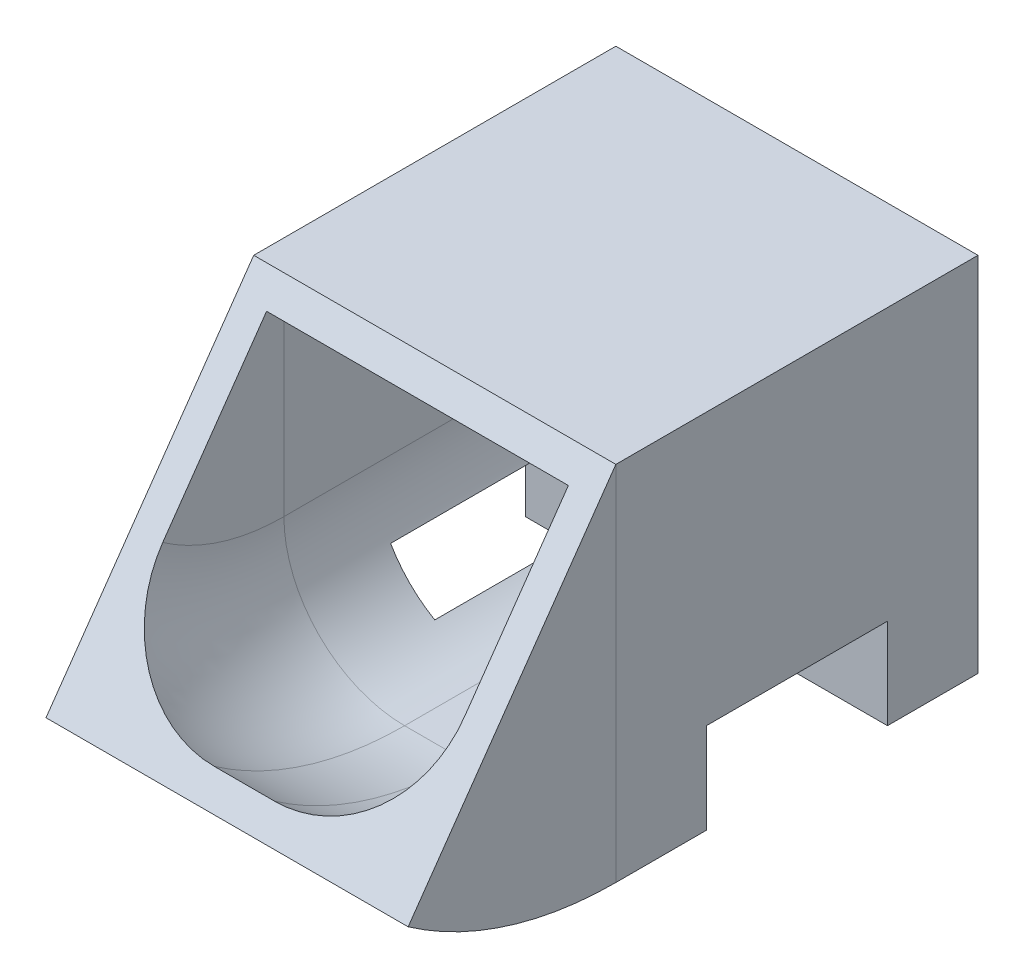
ISO-10303-21;
HEADER;
FILE_DESCRIPTION(('STEP AP214'),'2;1');
FILE_NAME('part.step','',(''),(''),'','','');
FILE_SCHEMA(('AUTOMOTIVE_DESIGN { 1 0 10303 214 1 1 1 1 }'));
ENDSEC;
DATA;
#1=APPLICATION_CONTEXT('core data for automotive mechanical design processes');
#2=APPLICATION_PROTOCOL_DEFINITION('international standard','automotive_design',2000,#1);
#3=PRODUCT_CONTEXT('',#1,'mechanical');
#4=PRODUCT('Part','Part','',(#3));
#5=PRODUCT_RELATED_PRODUCT_CATEGORY('part','',(#4));
#6=PRODUCT_DEFINITION_FORMATION('','',#4);
#7=PRODUCT_DEFINITION_CONTEXT('part definition',#1,'design');
#8=PRODUCT_DEFINITION('design','',#6,#7);
#9=PRODUCT_DEFINITION_SHAPE('','',#8);
#10=(LENGTH_UNIT() NAMED_UNIT(*) SI_UNIT(.MILLI.,.METRE.));
#11=(NAMED_UNIT(*) PLANE_ANGLE_UNIT() SI_UNIT($,.RADIAN.));
#12=(NAMED_UNIT(*) SI_UNIT($,.STERADIAN.) SOLID_ANGLE_UNIT());
#13=UNCERTAINTY_MEASURE_WITH_UNIT(LENGTH_MEASURE(1.E-05),#10,'distance_accuracy_value','');
#14=(GEOMETRIC_REPRESENTATION_CONTEXT(3) GLOBAL_UNCERTAINTY_ASSIGNED_CONTEXT((#13)) GLOBAL_UNIT_ASSIGNED_CONTEXT((#10,
#11,#12)) REPRESENTATION_CONTEXT('',''));
#15=CARTESIAN_POINT('',(0.,0.,0.));
#16=DIRECTION('',(0.,0.,1.));
#17=DIRECTION('',(1.,0.,0.));
#18=AXIS2_PLACEMENT_3D('',#15,#16,#17);
#19=CARTESIAN_POINT('',(0.,60.,60.));
#20=DIRECTION('',(1.,0.,0.));
#21=DIRECTION('',(0.,0.,-1.));
#22=AXIS2_PLACEMENT_3D('',#19,#20,#21);
#23=PLANE('',#22);
#24=CARTESIAN_POINT('',(0.,60.,60.));
#25=DIRECTION('',(1.,0.,0.));
#26=DIRECTION('',(0.,0.,-1.));
#27=AXIS2_PLACEMENT_3D('',#24,#25,#26);
#28=CIRCLE('',#27,60.);
#29=CARTESIAN_POINT('',(0.,10.8508773426605,94.4145861810628));
#30=VERTEX_POINT('',#29);
#31=CARTESIAN_POINT('',(0.,0.,60.));
#32=VERTEX_POINT('',#31);
#33=EDGE_CURVE('E173',#30,#32,#28,.T.);
#34=ORIENTED_EDGE('',*,*,#33,.F.);
#35=DIRECTION('',(0.,-0.819152044288991,0.573576436351047));
#36=VECTOR('',#35,1.);
#37=CARTESIAN_POINT('',(0.,60.,60.));
#38=LINE('',#37,#36);
#39=CARTESIAN_POINT('',(0.,60.,60.));
#40=VERTEX_POINT('',#39);
#41=EDGE_CURVE('E159',#40,#30,#38,.T.);
#42=ORIENTED_EDGE('',*,*,#41,.F.);
#43=DIRECTION('',(0.,-1.,0.));
#44=VECTOR('',#43,1.);
#45=CARTESIAN_POINT('',(0.,60.,60.));
#46=LINE('',#45,#44);
#47=EDGE_CURVE('E142',#40,#32,#46,.T.);
#48=ORIENTED_EDGE('',*,*,#47,.T.);
#49=EDGE_LOOP('',(#34,#42,#48));
#50=FACE_BOUND('',#49,.T.);
#51=ADVANCED_FACE('F43',(#50),#23,.F.);
#52=CARTESIAN_POINT('',(0.,60.,60.));
#53=DIRECTION('',(1.,0.,0.));
#54=DIRECTION('',(0.,0.,-1.));
#55=AXIS2_PLACEMENT_3D('',#52,#53,#54);
#56=CYLINDRICAL_SURFACE('',#55,60.);
#57=CARTESIAN_POINT('',(60.,60.,60.));
#58=DIRECTION('',(1.,0.,0.));
#59=DIRECTION('',(0.,0.,-1.));
#60=AXIS2_PLACEMENT_3D('',#57,#58,#59);
#61=CIRCLE('',#60,60.);
#62=CARTESIAN_POINT('',(60.,10.8508773426605,94.4145861810628));
#63=VERTEX_POINT('',#62);
#64=CARTESIAN_POINT('',(60.,0.,60.));
#65=VERTEX_POINT('',#64);
#66=EDGE_CURVE('E123',#63,#65,#61,.T.);
#67=ORIENTED_EDGE('',*,*,#66,.F.);
#68=DIRECTION('',(1.,0.,0.));
#69=VECTOR('',#68,1.);
#70=CARTESIAN_POINT('',(0.,10.8508773426605,94.4145861810628));
#71=LINE('',#70,#69);
#72=EDGE_CURVE('E162',#30,#63,#71,.T.);
#73=ORIENTED_EDGE('',*,*,#72,.F.);
#74=ORIENTED_EDGE('',*,*,#33,.T.);
#75=DIRECTION('',(1.,0.,0.));
#76=VECTOR('',#75,1.);
#77=CARTESIAN_POINT('',(0.,0.,60.));
#78=LINE('',#77,#76);
#79=EDGE_CURVE('E145',#32,#65,#78,.T.);
#80=ORIENTED_EDGE('',*,*,#79,.T.);
#81=EDGE_LOOP('',(#67,#73,#74,#80));
#82=FACE_BOUND('',#81,.T.);
#83=ADVANCED_FACE('F204',(#82),#56,.T.);
#84=CARTESIAN_POINT('',(60.,60.,60.));
#85=DIRECTION('',(-1.,0.,0.));
#86=DIRECTION('',(0.,0.,1.));
#87=AXIS2_PLACEMENT_3D('',#84,#85,#86);
#88=PLANE('',#87);
#89=DIRECTION('',(0.,1.,0.));
#90=VECTOR('',#89,1.);
#91=CARTESIAN_POINT('',(60.,60.,60.));
#92=LINE('',#91,#90);
#93=CARTESIAN_POINT('',(60.,60.,60.));
#94=VERTEX_POINT('',#93);
#95=EDGE_CURVE('E148',#65,#94,#92,.T.);
#96=ORIENTED_EDGE('',*,*,#95,.T.);
#97=DIRECTION('',(0.,0.819152044288991,-0.573576436351047));
#98=VECTOR('',#97,1.);
#99=CARTESIAN_POINT('',(60.,60.,60.));
#100=LINE('',#99,#98);
#101=EDGE_CURVE('E165',#63,#94,#100,.T.);
#102=ORIENTED_EDGE('',*,*,#101,.F.);
#103=ORIENTED_EDGE('',*,*,#66,.T.);
#104=EDGE_LOOP('',(#96,#102,#103));
#105=FACE_BOUND('',#104,.T.);
#106=ADVANCED_FACE('F210',(#105),#88,.F.);
#107=CARTESIAN_POINT('',(5.,55.904239778555,62.8678821817552));
#108=DIRECTION('',(1.,0.,0.));
#109=DIRECTION('',(0.,0.,-1.));
#110=AXIS2_PLACEMENT_3D('',#107,#108,#109);
#111=PLANE('',#110);
#112=DIRECTION('',(0.,-0.819152044288991,0.573576436351047));
#113=VECTOR('',#112,1.);
#114=CARTESIAN_POINT('',(5.,55.904239778555,62.8678821817552));
#115=LINE('',#114,#113);
#116=CARTESIAN_POINT('',(5.,55.904239778555,62.8678821817552));
#117=VERTEX_POINT('',#116);
#118=CARTESIAN_POINT('',(5.,31.3296784498853,80.0751752722867));
#119=VERTEX_POINT('',#118);
#120=EDGE_CURVE('E151',#117,#119,#115,.T.);
#121=ORIENTED_EDGE('',*,*,#120,.T.);
#122=CARTESIAN_POINT('',(5.,60.,60.));
#123=DIRECTION('',(1.,0.,0.));
#124=DIRECTION('',(0.,0.,-1.));
#125=AXIS2_PLACEMENT_3D('',#122,#123,#124);
#126=CIRCLE('',#125,35.);
#127=CARTESIAN_POINT('',(5.,25.,60.));
#128=VERTEX_POINT('',#127);
#129=EDGE_CURVE('E131',#119,#128,#126,.T.);
#130=ORIENTED_EDGE('',*,*,#129,.T.);
#131=DIRECTION('',(0.,-1.,0.));
#132=VECTOR('',#131,1.);
#133=CARTESIAN_POINT('',(5.,55.,60.));
#134=LINE('',#133,#132);
#135=CARTESIAN_POINT('',(5.,55.,60.));
#136=VERTEX_POINT('',#135);
#137=EDGE_CURVE('E128',#136,#128,#134,.T.);
#138=ORIENTED_EDGE('',*,*,#137,.F.);
#139=CARTESIAN_POINT('',(5.,60.,60.));
#140=DIRECTION('',(1.,0.,0.));
#141=DIRECTION('',(0.,0.,-1.));
#142=AXIS2_PLACEMENT_3D('',#139,#140,#141);
#143=CIRCLE('',#142,5.);
#144=EDGE_CURVE('E112',#117,#136,#143,.T.);
#145=ORIENTED_EDGE('',*,*,#144,.F.);
#146=EDGE_LOOP('',(#121,#130,#138,#145));
#147=FACE_BOUND('',#146,.T.);
#148=ADVANCED_FACE('F129',(#147),#111,.T.);
#149=CARTESIAN_POINT('',(0.,60.,60.));
#150=DIRECTION('',(1.,0.,0.));
#151=DIRECTION('',(0.,0.,-1.));
#152=AXIS2_PLACEMENT_3D('',#149,#150,#151);
#153=CYLINDRICAL_SURFACE('',#152,5.);
#154=CARTESIAN_POINT('',(55.,60.,60.));
#155=DIRECTION('',(1.,0.,0.));
#156=DIRECTION('',(0.,0.,-1.));
#157=AXIS2_PLACEMENT_3D('',#154,#155,#156);
#158=CIRCLE('',#157,5.);
#159=CARTESIAN_POINT('',(55.,55.904239778555,62.8678821817552));
#160=VERTEX_POINT('',#159);
#161=CARTESIAN_POINT('',(55.,55.,60.));
#162=VERTEX_POINT('',#161);
#163=EDGE_CURVE('E124',#160,#162,#158,.T.);
#164=ORIENTED_EDGE('',*,*,#163,.F.);
#165=DIRECTION('',(-1.,0.,0.));
#166=VECTOR('',#165,1.);
#167=CARTESIAN_POINT('',(5.,55.904239778555,62.8678821817552));
#168=LINE('',#167,#166);
#169=EDGE_CURVE('E119',#160,#117,#168,.T.);
#170=ORIENTED_EDGE('',*,*,#169,.T.);
#171=ORIENTED_EDGE('',*,*,#144,.T.);
#172=DIRECTION('',(-1.,0.,0.));
#173=VECTOR('',#172,1.);
#174=CARTESIAN_POINT('',(5.,55.,60.));
#175=LINE('',#174,#173);
#176=EDGE_CURVE('E117',#162,#136,#175,.T.);
#177=ORIENTED_EDGE('',*,*,#176,.F.);
#178=EDGE_LOOP('',(#164,#170,#171,#177));
#179=FACE_BOUND('',#178,.T.);
#180=ADVANCED_FACE('F115',(#179),#153,.T.);
#181=CARTESIAN_POINT('',(55.,55.904239778555,62.8678821817552));
#182=DIRECTION('',(-1.,0.,0.));
#183=DIRECTION('',(0.,0.,1.));
#184=AXIS2_PLACEMENT_3D('',#181,#182,#183);
#185=PLANE('',#184);
#186=DIRECTION('',(0.,1.,0.));
#187=VECTOR('',#186,1.);
#188=CARTESIAN_POINT('',(55.,55.,60.));
#189=LINE('',#188,#187);
#190=CARTESIAN_POINT('',(55.,25.,60.));
#191=VERTEX_POINT('',#190);
#192=EDGE_CURVE('E135',#191,#162,#189,.T.);
#193=ORIENTED_EDGE('',*,*,#192,.F.);
#194=CARTESIAN_POINT('',(55.,60.,60.));
#195=DIRECTION('',(-1.,0.,0.));
#196=DIRECTION('',(0.,0.,1.));
#197=AXIS2_PLACEMENT_3D('',#194,#195,#196);
#198=CIRCLE('',#197,35.);
#199=CARTESIAN_POINT('',(55.,31.3296784498853,80.0751752722867));
#200=VERTEX_POINT('',#199);
#201=EDGE_CURVE('E64',#191,#200,#198,.T.);
#202=ORIENTED_EDGE('',*,*,#201,.T.);
#203=DIRECTION('',(0.,0.819152044288991,-0.573576436351047));
#204=VECTOR('',#203,1.);
#205=CARTESIAN_POINT('',(55.,55.904239778555,62.8678821817552));
#206=LINE('',#205,#204);
#207=EDGE_CURVE('E154',#200,#160,#206,.T.);
#208=ORIENTED_EDGE('',*,*,#207,.T.);
#209=ORIENTED_EDGE('',*,*,#163,.T.);
#210=EDGE_LOOP('',(#193,#202,#208,#209));
#211=FACE_BOUND('',#210,.T.);
#212=ADVANCED_FACE('F235',(#211),#185,.T.);
#213=CARTESIAN_POINT('',(0.,60.,60.));
#214=DIRECTION('',(1.,0.,0.));
#215=DIRECTION('',(0.,0.,-1.));
#216=AXIS2_PLACEMENT_3D('',#213,#214,#215);
#217=CYLINDRICAL_SURFACE('',#216,55.);
#218=DIRECTION('',(1.,0.,0.));
#219=VECTOR('',#218,1.);
#220=CARTESIAN_POINT('',(5.,14.9466375641055,91.5467039993076));
#221=LINE('',#220,#219);
#222=CARTESIAN_POINT('',(25.,14.9466375641055,91.5467039993076));
#223=VERTEX_POINT('',#222);
#224=CARTESIAN_POINT('',(35.,14.9466375641055,91.5467039993076));
#225=VERTEX_POINT('',#224);
#226=EDGE_CURVE('E156',#223,#225,#221,.T.);
#227=ORIENTED_EDGE('',*,*,#226,.T.);
#228=CARTESIAN_POINT('',(35.,60.,60.));
#229=DIRECTION('',(-1.,0.,0.));
#230=DIRECTION('',(0.,0.,1.));
#231=AXIS2_PLACEMENT_3D('',#228,#229,#230);
#232=CIRCLE('',#231,55.);
#233=CARTESIAN_POINT('',(35.,4.99999999999999,60.));
#234=VERTEX_POINT('',#233);
#235=EDGE_CURVE('E182',#225,#234,#232,.F.);
#236=ORIENTED_EDGE('',*,*,#235,.T.);
#237=DIRECTION('',(1.,0.,0.));
#238=VECTOR('',#237,1.);
#239=CARTESIAN_POINT('',(5.,4.99999999999999,60.));
#240=LINE('',#239,#238);
#241=CARTESIAN_POINT('',(25.,4.99999999999999,60.));
#242=VERTEX_POINT('',#241);
#243=EDGE_CURVE('E138',#242,#234,#240,.T.);
#244=ORIENTED_EDGE('',*,*,#243,.F.);
#245=CARTESIAN_POINT('',(25.,60.,60.));
#246=DIRECTION('',(1.,0.,0.));
#247=DIRECTION('',(0.,0.,-1.));
#248=AXIS2_PLACEMENT_3D('',#245,#246,#247);
#249=CIRCLE('',#248,55.);
#250=EDGE_CURVE('E176',#242,#223,#249,.F.);
#251=ORIENTED_EDGE('',*,*,#250,.T.);
#252=EDGE_LOOP('',(#227,#236,#244,#251));
#253=FACE_BOUND('',#252,.T.);
#254=ADVANCED_FACE('F188',(#253),#217,.F.);
#255=CARTESIAN_POINT('',(0.,10.8508773426605,94.4145861810628));
#256=DIRECTION('',(0.,0.573576436351047,0.819152044288991));
#257=DIRECTION('',(1.,0.,0.));
#258=AXIS2_PLACEMENT_3D('',#255,#256,#257);
#259=PLANE('',#258);
#260=ORIENTED_EDGE('',*,*,#120,.F.);
#261=ORIENTED_EDGE('',*,*,#169,.F.);
#262=ORIENTED_EDGE('',*,*,#207,.F.);
#263=CARTESIAN_POINT('',(35.,31.3296784498853,80.0751752722867));
#264=DIRECTION('',(0.,0.573576436351047,0.819152044288991));
#265=DIRECTION('',(0.,-0.819152044288991,0.573576436351047));
#266=AXIS2_PLACEMENT_3D('',#263,#264,#265);
#267=CIRCLE('',#266,20.);
#268=EDGE_CURVE('E12',#200,#225,#267,.F.);
#269=ORIENTED_EDGE('',*,*,#268,.T.);
#270=ORIENTED_EDGE('',*,*,#226,.F.);
#271=CARTESIAN_POINT('',(25.,31.3296784498853,80.0751752722867));
#272=DIRECTION('',(0.,0.573576436351047,0.819152044288991));
#273=DIRECTION('',(0.,-0.819152044288991,0.573576436351047));
#274=AXIS2_PLACEMENT_3D('',#271,#272,#273);
#275=CIRCLE('',#274,20.);
#276=EDGE_CURVE('E180',#223,#119,#275,.F.);
#277=ORIENTED_EDGE('',*,*,#276,.T.);
#278=EDGE_LOOP('',(#260,#261,#262,#269,#270,#277));
#279=FACE_BOUND('',#278,.T.);
#280=ORIENTED_EDGE('',*,*,#41,.T.);
#281=ORIENTED_EDGE('',*,*,#72,.T.);
#282=ORIENTED_EDGE('',*,*,#101,.T.);
#283=DIRECTION('',(-1.,0.,0.));
#284=VECTOR('',#283,1.);
#285=CARTESIAN_POINT('',(0.,60.,60.));
#286=LINE('',#285,#284);
#287=EDGE_CURVE('E168',#94,#40,#286,.T.);
#288=ORIENTED_EDGE('',*,*,#287,.T.);
#289=EDGE_LOOP('',(#280,#281,#282,#288));
#290=FACE_BOUND('',#289,.T.);
#291=ADVANCED_FACE('F197',(#279,#290),#259,.T.);
#292=CARTESIAN_POINT('',(0.,0.,60.));
#293=DIRECTION('',(0.,0.,1.));
#294=DIRECTION('',(1.,0.,0.));
#295=AXIS2_PLACEMENT_3D('',#292,#293,#294);
#296=PLANE('',#295);
#297=ORIENTED_EDGE('',*,*,#137,.T.);
#298=CARTESIAN_POINT('',(25.,25.,60.));
#299=DIRECTION('',(0.,0.,1.));
#300=DIRECTION('',(1.,0.,0.));
#301=AXIS2_PLACEMENT_3D('',#298,#299,#300);
#302=CIRCLE('',#301,20.);
#303=EDGE_CURVE('E178',#128,#242,#302,.T.);
#304=ORIENTED_EDGE('',*,*,#303,.T.);
#305=ORIENTED_EDGE('',*,*,#243,.T.);
#306=CARTESIAN_POINT('',(35.,25.,60.));
#307=DIRECTION('',(0.,0.,1.));
#308=DIRECTION('',(1.,0.,0.));
#309=AXIS2_PLACEMENT_3D('',#306,#307,#308);
#310=CIRCLE('',#309,20.);
#311=EDGE_CURVE('E51',#234,#191,#310,.T.);
#312=ORIENTED_EDGE('',*,*,#311,.T.);
#313=ORIENTED_EDGE('',*,*,#192,.T.);
#314=ORIENTED_EDGE('',*,*,#176,.T.);
#315=EDGE_LOOP('',(#297,#304,#305,#312,#313,#314));
#316=FACE_BOUND('',#315,.T.);
#317=ORIENTED_EDGE('',*,*,#47,.F.);
#318=ORIENTED_EDGE('',*,*,#287,.F.);
#319=ORIENTED_EDGE('',*,*,#95,.F.);
#320=ORIENTED_EDGE('',*,*,#79,.F.);
#321=EDGE_LOOP('',(#317,#318,#319,#320));
#322=FACE_BOUND('',#321,.T.);
#323=ADVANCED_FACE('F133',(#316,#322),#296,.F.);
#324=CARTESIAN_POINT('',(25.,60.,60.));
#325=DIRECTION('',(1.,0.,0.));
#326=DIRECTION('',(0.,0.,-1.));
#327=AXIS2_PLACEMENT_3D('',#324,#325,#326);
#328=TOROIDAL_SURFACE('',#327,35.,20.);
#329=ORIENTED_EDGE('',*,*,#276,.F.);
#330=ORIENTED_EDGE('',*,*,#250,.F.);
#331=ORIENTED_EDGE('',*,*,#303,.F.);
#332=ORIENTED_EDGE('',*,*,#129,.F.);
#333=EDGE_LOOP('',(#329,#330,#331,#332));
#334=FACE_BOUND('',#333,.T.);
#335=ADVANCED_FACE('F195',(#334),#328,.F.);
#336=CARTESIAN_POINT('',(35.,60.,60.));
#337=DIRECTION('',(-1.,0.,0.));
#338=DIRECTION('',(0.,0.,1.));
#339=AXIS2_PLACEMENT_3D('',#336,#337,#338);
#340=TOROIDAL_SURFACE('',#339,35.,20.);
#341=ORIENTED_EDGE('',*,*,#268,.F.);
#342=ORIENTED_EDGE('',*,*,#201,.F.);
#343=ORIENTED_EDGE('',*,*,#311,.F.);
#344=ORIENTED_EDGE('',*,*,#235,.F.);
#345=EDGE_LOOP('',(#341,#342,#343,#344));
#346=FACE_BOUND('',#345,.T.);
#347=ADVANCED_FACE('F45',(#346),#340,.F.);
#348=CLOSED_SHELL('',(#51,#83,#106,#148,#180,#212,#254,#291,#323,#335,#347));
#349=MANIFOLD_SOLID_BREP('B2',#348);
#350=CARTESIAN_POINT('',(0.,0.,60.));
#351=DIRECTION('',(0.,0.,-1.));
#352=DIRECTION('',(-1.,0.,0.));
#353=AXIS2_PLACEMENT_3D('',#350,#351,#352);
#354=PLANE('',#353);
#355=DIRECTION('',(0.,-1.,0.));
#356=VECTOR('',#355,1.);
#357=CARTESIAN_POINT('',(0.,0.,60.));
#358=LINE('',#357,#356);
#359=CARTESIAN_POINT('',(0.,60.,60.));
#360=VERTEX_POINT('',#359);
#361=CARTESIAN_POINT('',(0.,0.,60.));
#362=VERTEX_POINT('',#361);
#363=EDGE_CURVE('E595',#360,#362,#358,.T.);
#364=ORIENTED_EDGE('',*,*,#363,.T.);
#365=DIRECTION('',(1.,0.,0.));
#366=VECTOR('',#365,1.);
#367=CARTESIAN_POINT('',(0.,0.,60.));
#368=LINE('',#367,#366);
#369=CARTESIAN_POINT('',(60.,0.,60.));
#370=VERTEX_POINT('',#369);
#371=EDGE_CURVE('E598',#362,#370,#368,.T.);
#372=ORIENTED_EDGE('',*,*,#371,.T.);
#373=DIRECTION('',(0.,1.,0.));
#374=VECTOR('',#373,1.);
#375=CARTESIAN_POINT('',(60.,0.,60.));
#376=LINE('',#375,#374);
#377=CARTESIAN_POINT('',(60.,60.,60.));
#378=VERTEX_POINT('',#377);
#379=EDGE_CURVE('E601',#370,#378,#376,.T.);
#380=ORIENTED_EDGE('',*,*,#379,.T.);
#381=DIRECTION('',(-1.,0.,0.));
#382=VECTOR('',#381,1.);
#383=CARTESIAN_POINT('',(0.,60.,60.));
#384=LINE('',#383,#382);
#385=EDGE_CURVE('E603',#378,#360,#384,.T.);
#386=ORIENTED_EDGE('',*,*,#385,.T.);
#387=EDGE_LOOP('',(#364,#372,#380,#386));
#388=FACE_BOUND('',#387,.T.);
#389=DIRECTION('',(0.,-1.,0.));
#390=VECTOR('',#389,1.);
#391=CARTESIAN_POINT('',(5.,4.99999999999999,60.));
#392=LINE('',#391,#390);
#393=CARTESIAN_POINT('',(5.,55.,60.));
#394=VERTEX_POINT('',#393);
#395=CARTESIAN_POINT('',(5.,25.,60.));
#396=VERTEX_POINT('',#395);
#397=EDGE_CURVE('E444',#394,#396,#392,.T.);
#398=ORIENTED_EDGE('',*,*,#397,.F.);
#399=DIRECTION('',(-1.,0.,0.));
#400=VECTOR('',#399,1.);
#401=CARTESIAN_POINT('',(5.,55.,60.));
#402=LINE('',#401,#400);
#403=CARTESIAN_POINT('',(55.,55.,60.));
#404=VERTEX_POINT('',#403);
#405=EDGE_CURVE('E581',#404,#394,#402,.T.);
#406=ORIENTED_EDGE('',*,*,#405,.F.);
#407=DIRECTION('',(0.,1.,0.));
#408=VECTOR('',#407,1.);
#409=CARTESIAN_POINT('',(55.,4.99999999999999,60.));
#410=LINE('',#409,#408);
#411=CARTESIAN_POINT('',(55.,25.,60.));
#412=VERTEX_POINT('',#411);
#413=EDGE_CURVE('E579',#412,#404,#410,.T.);
#414=ORIENTED_EDGE('',*,*,#413,.F.);
#415=CARTESIAN_POINT('',(35.,25.,60.));
#416=DIRECTION('',(0.,0.,-1.));
#417=DIRECTION('',(-1.,0.,0.));
#418=AXIS2_PLACEMENT_3D('',#415,#416,#417);
#419=CIRCLE('',#418,20.);
#420=CARTESIAN_POINT('',(35.,4.99999999999999,60.));
#421=VERTEX_POINT('',#420);
#422=EDGE_CURVE('E461',#412,#421,#419,.T.);
#423=ORIENTED_EDGE('',*,*,#422,.T.);
#424=DIRECTION('',(1.,0.,0.));
#425=VECTOR('',#424,1.);
#426=CARTESIAN_POINT('',(5.,4.99999999999999,60.));
#427=LINE('',#426,#425);
#428=CARTESIAN_POINT('',(25.,4.99999999999999,60.));
#429=VERTEX_POINT('',#428);
#430=EDGE_CURVE('E446',#429,#421,#427,.T.);
#431=ORIENTED_EDGE('',*,*,#430,.F.);
#432=CARTESIAN_POINT('',(25.,25.,60.));
#433=DIRECTION('',(0.,0.,-1.));
#434=DIRECTION('',(-1.,0.,0.));
#435=AXIS2_PLACEMENT_3D('',#432,#433,#434);
#436=CIRCLE('',#435,20.);
#437=EDGE_CURVE('E41',#429,#396,#436,.T.);
#438=ORIENTED_EDGE('',*,*,#437,.T.);
#439=EDGE_LOOP('',(#398,#406,#414,#423,#431,#438));
#440=FACE_BOUND('',#439,.T.);
#441=ADVANCED_FACE('F299',(#388,#440),#354,.F.);
#442=CARTESIAN_POINT('',(0.,0.,0.));
#443=DIRECTION('',(0.,0.,-1.));
#444=DIRECTION('',(-1.,0.,0.));
#445=AXIS2_PLACEMENT_3D('',#442,#443,#444);
#446=PLANE('',#445);
#447=DIRECTION('',(0.,-1.,0.));
#448=VECTOR('',#447,1.);
#449=CARTESIAN_POINT('',(0.,0.,0.));
#450=LINE('',#449,#448);
#451=CARTESIAN_POINT('',(0.,60.,0.));
#452=VERTEX_POINT('',#451);
#453=CARTESIAN_POINT('',(0.,0.,0.));
#454=VERTEX_POINT('',#453);
#455=EDGE_CURVE('E594',#452,#454,#450,.T.);
#456=ORIENTED_EDGE('',*,*,#455,.F.);
#457=DIRECTION('',(-1.,0.,0.));
#458=VECTOR('',#457,1.);
#459=CARTESIAN_POINT('',(0.,60.,0.));
#460=LINE('',#459,#458);
#461=CARTESIAN_POINT('',(60.,60.,0.));
#462=VERTEX_POINT('',#461);
#463=EDGE_CURVE('E599',#462,#452,#460,.T.);
#464=ORIENTED_EDGE('',*,*,#463,.F.);
#465=DIRECTION('',(0.,1.,0.));
#466=VECTOR('',#465,1.);
#467=CARTESIAN_POINT('',(60.,0.,0.));
#468=LINE('',#467,#466);
#469=CARTESIAN_POINT('',(60.,0.,0.));
#470=VERTEX_POINT('',#469);
#471=EDGE_CURVE('E611',#470,#462,#468,.T.);
#472=ORIENTED_EDGE('',*,*,#471,.F.);
#473=DIRECTION('',(1.,0.,0.));
#474=VECTOR('',#473,1.);
#475=CARTESIAN_POINT('',(0.,0.,0.));
#476=LINE('',#475,#474);
#477=EDGE_CURVE('E608',#454,#470,#476,.T.);
#478=ORIENTED_EDGE('',*,*,#477,.F.);
#479=EDGE_LOOP('',(#456,#464,#472,#478));
#480=FACE_BOUND('',#479,.T.);
#481=DIRECTION('',(-1.,0.,0.));
#482=VECTOR('',#481,1.);
#483=CARTESIAN_POINT('',(5.,55.,0.));
#484=LINE('',#483,#482);
#485=CARTESIAN_POINT('',(55.,55.,0.));
#486=VERTEX_POINT('',#485);
#487=CARTESIAN_POINT('',(5.,55.,0.));
#488=VERTEX_POINT('',#487);
#489=EDGE_CURVE('E457',#486,#488,#484,.T.);
#490=ORIENTED_EDGE('',*,*,#489,.T.);
#491=DIRECTION('',(0.,-1.,0.));
#492=VECTOR('',#491,1.);
#493=CARTESIAN_POINT('',(5.,4.99999999999999,0.));
#494=LINE('',#493,#492);
#495=CARTESIAN_POINT('',(5.,25.,0.));
#496=VERTEX_POINT('',#495);
#497=EDGE_CURVE('E473',#488,#496,#494,.T.);
#498=ORIENTED_EDGE('',*,*,#497,.T.);
#499=CARTESIAN_POINT('',(25.,25.,0.));
#500=DIRECTION('',(0.,0.,-1.));
#501=DIRECTION('',(-1.,0.,0.));
#502=AXIS2_PLACEMENT_3D('',#499,#500,#501);
#503=CIRCLE('',#502,20.);
#504=CARTESIAN_POINT('',(25.,4.99999999999999,0.));
#505=VERTEX_POINT('',#504);
#506=EDGE_CURVE('E309',#496,#505,#503,.F.);
#507=ORIENTED_EDGE('',*,*,#506,.T.);
#508=DIRECTION('',(1.,0.,0.));
#509=VECTOR('',#508,1.);
#510=CARTESIAN_POINT('',(5.,4.99999999999999,0.));
#511=LINE('',#510,#509);
#512=CARTESIAN_POINT('',(35.,4.99999999999999,0.));
#513=VERTEX_POINT('',#512);
#514=EDGE_CURVE('E584',#505,#513,#511,.T.);
#515=ORIENTED_EDGE('',*,*,#514,.T.);
#516=CARTESIAN_POINT('',(35.,25.,0.));
#517=DIRECTION('',(0.,0.,-1.));
#518=DIRECTION('',(-1.,0.,0.));
#519=AXIS2_PLACEMENT_3D('',#516,#517,#518);
#520=CIRCLE('',#519,20.);
#521=CARTESIAN_POINT('',(55.,25.,0.));
#522=VERTEX_POINT('',#521);
#523=EDGE_CURVE('E464',#513,#522,#520,.F.);
#524=ORIENTED_EDGE('',*,*,#523,.T.);
#525=DIRECTION('',(0.,1.,0.));
#526=VECTOR('',#525,1.);
#527=CARTESIAN_POINT('',(55.,4.99999999999999,0.));
#528=LINE('',#527,#526);
#529=EDGE_CURVE('E586',#522,#486,#528,.T.);
#530=ORIENTED_EDGE('',*,*,#529,.T.);
#531=EDGE_LOOP('',(#490,#498,#507,#515,#524,#530));
#532=FACE_BOUND('',#531,.T.);
#533=ADVANCED_FACE('F644',(#480,#532),#446,.T.);
#534=CARTESIAN_POINT('',(0.,0.,60.));
#535=DIRECTION('',(1.,0.,0.));
#536=DIRECTION('',(0.,1.,0.));
#537=AXIS2_PLACEMENT_3D('',#534,#535,#536);
#538=PLANE('',#537);
#539=DIRECTION('',(0.,0.,-1.));
#540=VECTOR('',#539,1.);
#541=CARTESIAN_POINT('',(0.,0.,60.));
#542=LINE('',#541,#540);
#543=CARTESIAN_POINT('',(0.,0.,15.));
#544=VERTEX_POINT('',#543);
#545=EDGE_CURVE('E482',#544,#454,#542,.T.);
#546=ORIENTED_EDGE('',*,*,#545,.F.);
#547=DIRECTION('',(0.,-1.,0.));
#548=VECTOR('',#547,1.);
#549=CARTESIAN_POINT('',(0.,0.,15.));
#550=LINE('',#549,#548);
#551=CARTESIAN_POINT('',(0.,15.,15.));
#552=VERTEX_POINT('',#551);
#553=EDGE_CURVE('E505',#552,#544,#550,.T.);
#554=ORIENTED_EDGE('',*,*,#553,.F.);
#555=DIRECTION('',(0.,0.,-1.));
#556=VECTOR('',#555,1.);
#557=CARTESIAN_POINT('',(0.,15.,15.));
#558=LINE('',#557,#556);
#559=CARTESIAN_POINT('',(0.,15.,45.));
#560=VERTEX_POINT('',#559);
#561=EDGE_CURVE('E561',#560,#552,#558,.T.);
#562=ORIENTED_EDGE('',*,*,#561,.F.);
#563=DIRECTION('',(0.,1.,0.));
#564=VECTOR('',#563,1.);
#565=CARTESIAN_POINT('',(0.,0.,45.));
#566=LINE('',#565,#564);
#567=CARTESIAN_POINT('',(0.,0.,45.));
#568=VERTEX_POINT('',#567);
#569=EDGE_CURVE('E566',#568,#560,#566,.T.);
#570=ORIENTED_EDGE('',*,*,#569,.F.);
#571=EDGE_CURVE('E480',#362,#568,#542,.T.);
#572=ORIENTED_EDGE('',*,*,#571,.F.);
#573=ORIENTED_EDGE('',*,*,#363,.F.);
#574=DIRECTION('',(0.,0.,-1.));
#575=VECTOR('',#574,1.);
#576=CARTESIAN_POINT('',(0.,60.,60.));
#577=LINE('',#576,#575);
#578=EDGE_CURVE('E605',#360,#452,#577,.T.);
#579=ORIENTED_EDGE('',*,*,#578,.T.);
#580=ORIENTED_EDGE('',*,*,#455,.T.);
#581=EDGE_LOOP('',(#546,#554,#562,#570,#572,#573,#579,#580));
#582=FACE_BOUND('',#581,.T.);
#583=ADVANCED_FACE('F651',(#582),#538,.F.);
#584=CARTESIAN_POINT('',(0.,0.,60.));
#585=DIRECTION('',(0.,1.,0.));
#586=DIRECTION('',(0.,0.,1.));
#587=AXIS2_PLACEMENT_3D('',#584,#585,#586);
#588=PLANE('',#587);
#589=DIRECTION('',(0.,0.,-1.));
#590=VECTOR('',#589,1.);
#591=CARTESIAN_POINT('',(45.,0.,45.));
#592=LINE('',#591,#590);
#593=CARTESIAN_POINT('',(45.,0.,45.));
#594=VERTEX_POINT('',#593);
#595=CARTESIAN_POINT('',(45.,0.,15.));
#596=VERTEX_POINT('',#595);
#597=EDGE_CURVE('E540',#594,#596,#592,.T.);
#598=ORIENTED_EDGE('',*,*,#597,.F.);
#599=DIRECTION('',(1.,0.,0.));
#600=VECTOR('',#599,1.);
#601=CARTESIAN_POINT('',(45.,0.,45.));
#602=LINE('',#601,#600);
#603=CARTESIAN_POINT('',(60.,0.,45.));
#604=VERTEX_POINT('',#603);
#605=EDGE_CURVE('E538',#594,#604,#602,.T.);
#606=ORIENTED_EDGE('',*,*,#605,.T.);
#607=DIRECTION('',(0.,0.,-1.));
#608=VECTOR('',#607,1.);
#609=CARTESIAN_POINT('',(60.,0.,60.));
#610=LINE('',#609,#608);
#611=EDGE_CURVE('E487',#370,#604,#610,.T.);
#612=ORIENTED_EDGE('',*,*,#611,.F.);
#613=ORIENTED_EDGE('',*,*,#371,.F.);
#614=ORIENTED_EDGE('',*,*,#571,.T.);
#615=DIRECTION('',(-1.,0.,0.));
#616=VECTOR('',#615,1.);
#617=CARTESIAN_POINT('',(15.,0.,45.));
#618=LINE('',#617,#616);
#619=CARTESIAN_POINT('',(15.,0.,45.));
#620=VERTEX_POINT('',#619);
#621=EDGE_CURVE('E574',#620,#568,#618,.T.);
#622=ORIENTED_EDGE('',*,*,#621,.F.);
#623=DIRECTION('',(0.,0.,1.));
#624=VECTOR('',#623,1.);
#625=CARTESIAN_POINT('',(15.,0.,15.));
#626=LINE('',#625,#624);
#627=CARTESIAN_POINT('',(15.,0.,15.));
#628=VERTEX_POINT('',#627);
#629=EDGE_CURVE('E560',#628,#620,#626,.T.);
#630=ORIENTED_EDGE('',*,*,#629,.F.);
#631=DIRECTION('',(-1.,0.,0.));
#632=VECTOR('',#631,1.);
#633=CARTESIAN_POINT('',(15.,0.,15.));
#634=LINE('',#633,#632);
#635=EDGE_CURVE('E564',#628,#544,#634,.T.);
#636=ORIENTED_EDGE('',*,*,#635,.T.);
#637=ORIENTED_EDGE('',*,*,#545,.T.);
#638=ORIENTED_EDGE('',*,*,#477,.T.);
#639=CARTESIAN_POINT('',(60.,0.,15.));
#640=VERTEX_POINT('',#639);
#641=EDGE_CURVE('E617',#640,#470,#610,.T.);
#642=ORIENTED_EDGE('',*,*,#641,.F.);
#643=DIRECTION('',(1.,0.,0.));
#644=VECTOR('',#643,1.);
#645=CARTESIAN_POINT('',(45.,0.,15.));
#646=LINE('',#645,#644);
#647=EDGE_CURVE('E555',#596,#640,#646,.T.);
#648=ORIENTED_EDGE('',*,*,#647,.F.);
#649=EDGE_LOOP('',(#598,#606,#612,#613,#614,#622,#630,#636,#637,#638,#642,#648));
#650=FACE_BOUND('',#649,.T.);
#651=ADVANCED_FACE('F634',(#650),#588,.F.);
#652=CARTESIAN_POINT('',(60.,0.,60.));
#653=DIRECTION('',(-1.,0.,0.));
#654=DIRECTION('',(0.,-1.,0.));
#655=AXIS2_PLACEMENT_3D('',#652,#653,#654);
#656=PLANE('',#655);
#657=ORIENTED_EDGE('',*,*,#611,.T.);
#658=DIRECTION('',(0.,-1.,0.));
#659=VECTOR('',#658,1.);
#660=CARTESIAN_POINT('',(60.,0.,45.));
#661=LINE('',#660,#659);
#662=CARTESIAN_POINT('',(60.,15.,45.));
#663=VERTEX_POINT('',#662);
#664=EDGE_CURVE('E549',#663,#604,#661,.T.);
#665=ORIENTED_EDGE('',*,*,#664,.F.);
#666=DIRECTION('',(0.,0.,1.));
#667=VECTOR('',#666,1.);
#668=CARTESIAN_POINT('',(60.,15.,45.));
#669=LINE('',#668,#667);
#670=CARTESIAN_POINT('',(60.,15.,15.));
#671=VERTEX_POINT('',#670);
#672=EDGE_CURVE('E541',#671,#663,#669,.T.);
#673=ORIENTED_EDGE('',*,*,#672,.F.);
#674=DIRECTION('',(0.,1.,0.));
#675=VECTOR('',#674,1.);
#676=CARTESIAN_POINT('',(60.,0.,15.));
#677=LINE('',#676,#675);
#678=EDGE_CURVE('E545',#640,#671,#677,.T.);
#679=ORIENTED_EDGE('',*,*,#678,.F.);
#680=ORIENTED_EDGE('',*,*,#641,.T.);
#681=ORIENTED_EDGE('',*,*,#471,.T.);
#682=DIRECTION('',(0.,0.,-1.));
#683=VECTOR('',#682,1.);
#684=CARTESIAN_POINT('',(60.,60.,60.));
#685=LINE('',#684,#683);
#686=EDGE_CURVE('E615',#378,#462,#685,.T.);
#687=ORIENTED_EDGE('',*,*,#686,.F.);
#688=ORIENTED_EDGE('',*,*,#379,.F.);
#689=EDGE_LOOP('',(#657,#665,#673,#679,#680,#681,#687,#688));
#690=FACE_BOUND('',#689,.T.);
#691=ADVANCED_FACE('F630',(#690),#656,.F.);
#692=CARTESIAN_POINT('',(0.,60.,60.));
#693=DIRECTION('',(0.,-1.,0.));
#694=DIRECTION('',(1.,0.,0.));
#695=AXIS2_PLACEMENT_3D('',#692,#693,#694);
#696=PLANE('',#695);
#697=ORIENTED_EDGE('',*,*,#463,.T.);
#698=ORIENTED_EDGE('',*,*,#578,.F.);
#699=ORIENTED_EDGE('',*,*,#385,.F.);
#700=ORIENTED_EDGE('',*,*,#686,.T.);
#701=EDGE_LOOP('',(#697,#698,#699,#700));
#702=FACE_BOUND('',#701,.T.);
#703=ADVANCED_FACE('F646',(#702),#696,.F.);
#704=CARTESIAN_POINT('',(5.,4.99999999999999,60.));
#705=DIRECTION('',(1.,0.,0.));
#706=DIRECTION('',(0.,0.,-1.));
#707=AXIS2_PLACEMENT_3D('',#704,#705,#706);
#708=PLANE('',#707);
#709=ORIENTED_EDGE('',*,*,#397,.T.);
#710=DIRECTION('',(0.,0.,-1.));
#711=VECTOR('',#710,1.);
#712=CARTESIAN_POINT('',(5.,25.,45.));
#713=LINE('',#712,#711);
#714=EDGE_CURVE('E454',#396,#496,#713,.T.);
#715=ORIENTED_EDGE('',*,*,#714,.T.);
#716=ORIENTED_EDGE('',*,*,#497,.F.);
#717=DIRECTION('',(0.,0.,-1.));
#718=VECTOR('',#717,1.);
#719=CARTESIAN_POINT('',(5.,55.,60.));
#720=LINE('',#719,#718);
#721=EDGE_CURVE('E456',#394,#488,#720,.T.);
#722=ORIENTED_EDGE('',*,*,#721,.F.);
#723=EDGE_LOOP('',(#709,#715,#716,#722));
#724=FACE_BOUND('',#723,.T.);
#725=ADVANCED_FACE('F453',(#724),#708,.T.);
#726=CARTESIAN_POINT('',(5.,4.99999999999999,60.));
#727=DIRECTION('',(0.,1.,0.));
#728=DIRECTION('',(0.,0.,1.));
#729=AXIS2_PLACEMENT_3D('',#726,#727,#728);
#730=PLANE('',#729);
#731=ORIENTED_EDGE('',*,*,#514,.F.);
#732=DIRECTION('',(0.,0.,-1.));
#733=VECTOR('',#732,1.);
#734=CARTESIAN_POINT('',(25.,4.99999999999999,60.));
#735=LINE('',#734,#733);
#736=EDGE_CURVE('E460',#505,#429,#735,.F.);
#737=ORIENTED_EDGE('',*,*,#736,.T.);
#738=ORIENTED_EDGE('',*,*,#430,.T.);
#739=DIRECTION('',(0.,0.,-1.));
#740=VECTOR('',#739,1.);
#741=CARTESIAN_POINT('',(35.,4.99999999999999,45.));
#742=LINE('',#741,#740);
#743=EDGE_CURVE('E491',#421,#513,#742,.T.);
#744=ORIENTED_EDGE('',*,*,#743,.T.);
#745=EDGE_LOOP('',(#731,#737,#738,#744));
#746=FACE_BOUND('',#745,.T.);
#747=ADVANCED_FACE('F714',(#746),#730,.T.);
#748=CARTESIAN_POINT('',(55.,4.99999999999999,60.));
#749=DIRECTION('',(-1.,0.,0.));
#750=DIRECTION('',(0.,0.,1.));
#751=AXIS2_PLACEMENT_3D('',#748,#749,#750);
#752=PLANE('',#751);
#753=ORIENTED_EDGE('',*,*,#529,.F.);
#754=DIRECTION('',(0.,0.,-1.));
#755=VECTOR('',#754,1.);
#756=CARTESIAN_POINT('',(55.,25.,60.));
#757=LINE('',#756,#755);
#758=EDGE_CURVE('E494',#522,#412,#757,.F.);
#759=ORIENTED_EDGE('',*,*,#758,.T.);
#760=ORIENTED_EDGE('',*,*,#413,.T.);
#761=DIRECTION('',(0.,0.,-1.));
#762=VECTOR('',#761,1.);
#763=CARTESIAN_POINT('',(55.,55.,60.));
#764=LINE('',#763,#762);
#765=EDGE_CURVE('E591',#404,#486,#764,.T.);
#766=ORIENTED_EDGE('',*,*,#765,.T.);
#767=EDGE_LOOP('',(#753,#759,#760,#766));
#768=FACE_BOUND('',#767,.T.);
#769=ADVANCED_FACE('F710',(#768),#752,.T.);
#770=CARTESIAN_POINT('',(5.,55.,60.));
#771=DIRECTION('',(0.,-1.,0.));
#772=DIRECTION('',(0.,0.,-1.));
#773=AXIS2_PLACEMENT_3D('',#770,#771,#772);
#774=PLANE('',#773);
#775=ORIENTED_EDGE('',*,*,#489,.F.);
#776=ORIENTED_EDGE('',*,*,#765,.F.);
#777=ORIENTED_EDGE('',*,*,#405,.T.);
#778=ORIENTED_EDGE('',*,*,#721,.T.);
#779=EDGE_LOOP('',(#775,#776,#777,#778));
#780=FACE_BOUND('',#779,.T.);
#781=ADVANCED_FACE('F676',(#780),#774,.T.);
#782=CARTESIAN_POINT('',(15.,0.,15.));
#783=DIRECTION('',(0.,0.,-1.));
#784=DIRECTION('',(-1.,0.,0.));
#785=AXIS2_PLACEMENT_3D('',#782,#783,#784);
#786=PLANE('',#785);
#787=CARTESIAN_POINT('',(25.,25.,15.));
#788=DIRECTION('',(0.,0.,-1.));
#789=DIRECTION('',(-1.,0.,0.));
#790=AXIS2_PLACEMENT_3D('',#787,#788,#789);
#791=CIRCLE('',#790,20.);
#792=CARTESIAN_POINT('',(10.857864376269,10.857864376269,15.));
#793=VERTEX_POINT('',#792);
#794=CARTESIAN_POINT('',(7.67949192431122,15.,15.));
#795=VERTEX_POINT('',#794);
#796=EDGE_CURVE('E471',#793,#795,#791,.T.);
#797=ORIENTED_EDGE('',*,*,#796,.T.);
#798=DIRECTION('',(-1.,0.,0.));
#799=VECTOR('',#798,1.);
#800=CARTESIAN_POINT('',(15.,15.,15.));
#801=LINE('',#800,#799);
#802=EDGE_CURVE('E478',#795,#552,#801,.T.);
#803=ORIENTED_EDGE('',*,*,#802,.T.);
#804=ORIENTED_EDGE('',*,*,#553,.T.);
#805=ORIENTED_EDGE('',*,*,#635,.F.);
#806=DIRECTION('',(0.,-1.,0.));
#807=VECTOR('',#806,1.);
#808=CARTESIAN_POINT('',(15.,0.,15.));
#809=LINE('',#808,#807);
#810=CARTESIAN_POINT('',(15.,7.67949192431122,15.));
#811=VERTEX_POINT('',#810);
#812=EDGE_CURVE('E558',#811,#628,#809,.T.);
#813=ORIENTED_EDGE('',*,*,#812,.F.);
#814=CARTESIAN_POINT('',(25.,25.,15.));
#815=DIRECTION('',(0.,0.,-1.));
#816=DIRECTION('',(-1.,0.,0.));
#817=AXIS2_PLACEMENT_3D('',#814,#815,#816);
#818=CIRCLE('',#817,20.);
#819=EDGE_CURVE('E303',#811,#793,#818,.T.);
#820=ORIENTED_EDGE('',*,*,#819,.T.);
#821=EDGE_LOOP('',(#797,#803,#804,#805,#813,#820));
#822=FACE_BOUND('',#821,.T.);
#823=ADVANCED_FACE('F662',(#822),#786,.F.);
#824=CARTESIAN_POINT('',(15.,15.,15.));
#825=DIRECTION('',(0.,1.,0.));
#826=DIRECTION('',(-1.,0.,0.));
#827=AXIS2_PLACEMENT_3D('',#824,#825,#826);
#828=PLANE('',#827);
#829=DIRECTION('',(0.,0.,1.));
#830=VECTOR('',#829,1.);
#831=CARTESIAN_POINT('',(7.67949192431122,15.,30.));
#832=LINE('',#831,#830);
#833=CARTESIAN_POINT('',(7.67949192431122,15.,45.));
#834=VERTEX_POINT('',#833);
#835=EDGE_CURVE('E475',#795,#834,#832,.T.);
#836=ORIENTED_EDGE('',*,*,#835,.T.);
#837=DIRECTION('',(-1.,0.,0.));
#838=VECTOR('',#837,1.);
#839=CARTESIAN_POINT('',(15.,15.,45.));
#840=LINE('',#839,#838);
#841=EDGE_CURVE('E572',#834,#560,#840,.T.);
#842=ORIENTED_EDGE('',*,*,#841,.T.);
#843=ORIENTED_EDGE('',*,*,#561,.T.);
#844=ORIENTED_EDGE('',*,*,#802,.F.);
#845=EDGE_LOOP('',(#836,#842,#843,#844));
#846=FACE_BOUND('',#845,.T.);
#847=ADVANCED_FACE('F668',(#846),#828,.F.);
#848=CARTESIAN_POINT('',(15.,0.,45.));
#849=DIRECTION('',(0.,0.,1.));
#850=DIRECTION('',(1.,0.,0.));
#851=AXIS2_PLACEMENT_3D('',#848,#849,#850);
#852=PLANE('',#851);
#853=CARTESIAN_POINT('',(25.,25.,45.));
#854=DIRECTION('',(0.,0.,1.));
#855=DIRECTION('',(1.,0.,0.));
#856=AXIS2_PLACEMENT_3D('',#853,#854,#855);
#857=CIRCLE('',#856,20.);
#858=CARTESIAN_POINT('',(10.857864376269,10.857864376269,45.));
#859=VERTEX_POINT('',#858);
#860=EDGE_CURVE('E474',#834,#859,#857,.T.);
#861=ORIENTED_EDGE('',*,*,#860,.T.);
#862=CARTESIAN_POINT('',(25.,25.,45.));
#863=DIRECTION('',(0.,0.,1.));
#864=DIRECTION('',(1.,0.,0.));
#865=AXIS2_PLACEMENT_3D('',#862,#863,#864);
#866=CIRCLE('',#865,20.);
#867=CARTESIAN_POINT('',(15.,7.67949192431122,45.));
#868=VERTEX_POINT('',#867);
#869=EDGE_CURVE('E479',#859,#868,#866,.T.);
#870=ORIENTED_EDGE('',*,*,#869,.T.);
#871=DIRECTION('',(0.,1.,0.));
#872=VECTOR('',#871,1.);
#873=CARTESIAN_POINT('',(15.,0.,45.));
#874=LINE('',#873,#872);
#875=EDGE_CURVE('E351',#620,#868,#874,.T.);
#876=ORIENTED_EDGE('',*,*,#875,.F.);
#877=ORIENTED_EDGE('',*,*,#621,.T.);
#878=ORIENTED_EDGE('',*,*,#569,.T.);
#879=ORIENTED_EDGE('',*,*,#841,.F.);
#880=EDGE_LOOP('',(#861,#870,#876,#877,#878,#879));
#881=FACE_BOUND('',#880,.T.);
#882=ADVANCED_FACE('F655',(#881),#852,.F.);
#883=CARTESIAN_POINT('',(15.,0.,0.));
#884=DIRECTION('',(1.,0.,0.));
#885=DIRECTION('',(0.,1.,0.));
#886=AXIS2_PLACEMENT_3D('',#883,#884,#885);
#887=PLANE('',#886);
#888=DIRECTION('',(0.,0.,1.));
#889=VECTOR('',#888,1.);
#890=CARTESIAN_POINT('',(15.,7.67949192431122,30.));
#891=LINE('',#890,#889);
#892=EDGE_CURVE('E343',#868,#811,#891,.F.);
#893=ORIENTED_EDGE('',*,*,#892,.T.);
#894=ORIENTED_EDGE('',*,*,#812,.T.);
#895=ORIENTED_EDGE('',*,*,#629,.T.);
#896=ORIENTED_EDGE('',*,*,#875,.T.);
#897=EDGE_LOOP('',(#893,#894,#895,#896));
#898=FACE_BOUND('',#897,.T.);
#899=ADVANCED_FACE('F658',(#898),#887,.F.);
#900=CARTESIAN_POINT('',(45.,0.,45.));
#901=DIRECTION('',(0.,0.,1.));
#902=DIRECTION('',(1.,0.,0.));
#903=AXIS2_PLACEMENT_3D('',#900,#901,#902);
#904=PLANE('',#903);
#905=CARTESIAN_POINT('',(35.,25.,45.));
#906=DIRECTION('',(0.,0.,1.));
#907=DIRECTION('',(1.,0.,0.));
#908=AXIS2_PLACEMENT_3D('',#905,#906,#907);
#909=CIRCLE('',#908,20.);
#910=CARTESIAN_POINT('',(45.,7.6794919243112,45.));
#911=VERTEX_POINT('',#910);
#912=CARTESIAN_POINT('',(49.142135623731,10.857864376269,45.));
#913=VERTEX_POINT('',#912);
#914=EDGE_CURVE('E500',#911,#913,#909,.T.);
#915=ORIENTED_EDGE('',*,*,#914,.T.);
#916=CARTESIAN_POINT('',(35.,25.,45.));
#917=DIRECTION('',(0.,0.,1.));
#918=DIRECTION('',(1.,0.,0.));
#919=AXIS2_PLACEMENT_3D('',#916,#917,#918);
#920=CIRCLE('',#919,20.);
#921=CARTESIAN_POINT('',(52.3205080756888,15.,45.));
#922=VERTEX_POINT('',#921);
#923=EDGE_CURVE('E503',#913,#922,#920,.T.);
#924=ORIENTED_EDGE('',*,*,#923,.T.);
#925=DIRECTION('',(1.,0.,0.));
#926=VECTOR('',#925,1.);
#927=CARTESIAN_POINT('',(45.,15.,45.));
#928=LINE('',#927,#926);
#929=EDGE_CURVE('E501',#922,#663,#928,.T.);
#930=ORIENTED_EDGE('',*,*,#929,.T.);
#931=ORIENTED_EDGE('',*,*,#664,.T.);
#932=ORIENTED_EDGE('',*,*,#605,.F.);
#933=DIRECTION('',(0.,-1.,0.));
#934=VECTOR('',#933,1.);
#935=CARTESIAN_POINT('',(45.,0.,45.));
#936=LINE('',#935,#934);
#937=EDGE_CURVE('E531',#911,#594,#936,.T.);
#938=ORIENTED_EDGE('',*,*,#937,.F.);
#939=EDGE_LOOP('',(#915,#924,#930,#931,#932,#938));
#940=FACE_BOUND('',#939,.T.);
#941=ADVANCED_FACE('F535',(#940),#904,.F.);
#942=CARTESIAN_POINT('',(45.,15.,45.));
#943=DIRECTION('',(0.,1.,0.));
#944=DIRECTION('',(-1.,0.,0.));
#945=AXIS2_PLACEMENT_3D('',#942,#943,#944);
#946=PLANE('',#945);
#947=DIRECTION('',(0.,0.,1.));
#948=VECTOR('',#947,1.);
#949=CARTESIAN_POINT('',(52.3205080756888,15.,30.));
#950=LINE('',#949,#948);
#951=CARTESIAN_POINT('',(52.3205080756888,15.,15.));
#952=VERTEX_POINT('',#951);
#953=EDGE_CURVE('E506',#922,#952,#950,.F.);
#954=ORIENTED_EDGE('',*,*,#953,.T.);
#955=DIRECTION('',(1.,0.,0.));
#956=VECTOR('',#955,1.);
#957=CARTESIAN_POINT('',(45.,15.,15.));
#958=LINE('',#957,#956);
#959=EDGE_CURVE('E519',#952,#671,#958,.T.);
#960=ORIENTED_EDGE('',*,*,#959,.T.);
#961=ORIENTED_EDGE('',*,*,#672,.T.);
#962=ORIENTED_EDGE('',*,*,#929,.F.);
#963=EDGE_LOOP('',(#954,#960,#961,#962));
#964=FACE_BOUND('',#963,.T.);
#965=ADVANCED_FACE('F638',(#964),#946,.F.);
#966=CARTESIAN_POINT('',(45.,0.,15.));
#967=DIRECTION('',(0.,0.,-1.));
#968=DIRECTION('',(-1.,0.,0.));
#969=AXIS2_PLACEMENT_3D('',#966,#967,#968);
#970=PLANE('',#969);
#971=CARTESIAN_POINT('',(35.,25.,15.));
#972=DIRECTION('',(0.,0.,-1.));
#973=DIRECTION('',(-1.,0.,0.));
#974=AXIS2_PLACEMENT_3D('',#971,#972,#973);
#975=CIRCLE('',#974,20.);
#976=CARTESIAN_POINT('',(49.142135623731,10.857864376269,15.));
#977=VERTEX_POINT('',#976);
#978=CARTESIAN_POINT('',(45.,7.6794919243112,15.));
#979=VERTEX_POINT('',#978);
#980=EDGE_CURVE('E498',#977,#979,#975,.T.);
#981=ORIENTED_EDGE('',*,*,#980,.T.);
#982=DIRECTION('',(0.,1.,0.));
#983=VECTOR('',#982,1.);
#984=CARTESIAN_POINT('',(45.,0.,15.));
#985=LINE('',#984,#983);
#986=EDGE_CURVE('E533',#596,#979,#985,.T.);
#987=ORIENTED_EDGE('',*,*,#986,.F.);
#988=ORIENTED_EDGE('',*,*,#647,.T.);
#989=ORIENTED_EDGE('',*,*,#678,.T.);
#990=ORIENTED_EDGE('',*,*,#959,.F.);
#991=CARTESIAN_POINT('',(35.,25.,15.));
#992=DIRECTION('',(0.,0.,-1.));
#993=DIRECTION('',(-1.,0.,0.));
#994=AXIS2_PLACEMENT_3D('',#991,#992,#993);
#995=CIRCLE('',#994,20.);
#996=EDGE_CURVE('E467',#952,#977,#995,.T.);
#997=ORIENTED_EDGE('',*,*,#996,.T.);
#998=EDGE_LOOP('',(#981,#987,#988,#989,#990,#997));
#999=FACE_BOUND('',#998,.T.);
#1000=ADVANCED_FACE('F515',(#999),#970,.F.);
#1001=CARTESIAN_POINT('',(45.,0.,0.));
#1002=DIRECTION('',(-1.,0.,0.));
#1003=DIRECTION('',(0.,-1.,0.));
#1004=AXIS2_PLACEMENT_3D('',#1001,#1002,#1003);
#1005=PLANE('',#1004);
#1006=DIRECTION('',(0.,0.,1.));
#1007=VECTOR('',#1006,1.);
#1008=CARTESIAN_POINT('',(45.,7.67949192431121,30.));
#1009=LINE('',#1008,#1007);
#1010=EDGE_CURVE('E495',#979,#911,#1009,.T.);
#1011=ORIENTED_EDGE('',*,*,#1010,.T.);
#1012=ORIENTED_EDGE('',*,*,#937,.T.);
#1013=ORIENTED_EDGE('',*,*,#597,.T.);
#1014=ORIENTED_EDGE('',*,*,#986,.T.);
#1015=EDGE_LOOP('',(#1011,#1012,#1013,#1014));
#1016=FACE_BOUND('',#1015,.T.);
#1017=ADVANCED_FACE('F528',(#1016),#1005,.F.);
#1018=CARTESIAN_POINT('',(35.,25.,60.));
#1019=DIRECTION('',(0.,0.,1.));
#1020=DIRECTION('',(1.,0.,0.));
#1021=AXIS2_PLACEMENT_3D('',#1018,#1019,#1020);
#1022=CYLINDRICAL_SURFACE('',#1021,20.);
#1023=ORIENTED_EDGE('',*,*,#422,.F.);
#1024=ORIENTED_EDGE('',*,*,#758,.F.);
#1025=ORIENTED_EDGE('',*,*,#523,.F.);
#1026=ORIENTED_EDGE('',*,*,#743,.F.);
#1027=EDGE_LOOP('',(#1023,#1024,#1025,#1026));
#1028=FACE_BOUND('',#1027,.T.);
#1029=ORIENTED_EDGE('',*,*,#980,.F.);
#1030=ORIENTED_EDGE('',*,*,#996,.F.);
#1031=ORIENTED_EDGE('',*,*,#953,.F.);
#1032=ORIENTED_EDGE('',*,*,#923,.F.);
#1033=ORIENTED_EDGE('',*,*,#914,.F.);
#1034=ORIENTED_EDGE('',*,*,#1010,.F.);
#1035=EDGE_LOOP('',(#1029,#1030,#1031,#1032,#1033,#1034));
#1036=FACE_BOUND('',#1035,.T.);
#1037=ADVANCED_FACE('F522',(#1028,#1036),#1022,.F.);
#1038=CARTESIAN_POINT('',(25.,25.,60.));
#1039=DIRECTION('',(0.,0.,1.));
#1040=DIRECTION('',(1.,0.,0.));
#1041=AXIS2_PLACEMENT_3D('',#1038,#1039,#1040);
#1042=CYLINDRICAL_SURFACE('',#1041,20.);
#1043=ORIENTED_EDGE('',*,*,#437,.F.);
#1044=ORIENTED_EDGE('',*,*,#736,.F.);
#1045=ORIENTED_EDGE('',*,*,#506,.F.);
#1046=ORIENTED_EDGE('',*,*,#714,.F.);
#1047=EDGE_LOOP('',(#1043,#1044,#1045,#1046));
#1048=FACE_BOUND('',#1047,.T.);
#1049=ORIENTED_EDGE('',*,*,#796,.F.);
#1050=ORIENTED_EDGE('',*,*,#819,.F.);
#1051=ORIENTED_EDGE('',*,*,#892,.F.);
#1052=ORIENTED_EDGE('',*,*,#869,.F.);
#1053=ORIENTED_EDGE('',*,*,#860,.F.);
#1054=ORIENTED_EDGE('',*,*,#835,.F.);
#1055=EDGE_LOOP('',(#1049,#1050,#1051,#1052,#1053,#1054));
#1056=FACE_BOUND('',#1055,.T.);
#1057=ADVANCED_FACE('F301',(#1048,#1056),#1042,.F.);
#1058=CLOSED_SHELL('',(#441,#533,#583,#651,#691,#703,#725,#747,#769,#781,#823,#847,#882,#899,
#941,#965,#1000,#1017,#1037,#1057));
#1059=MANIFOLD_SOLID_BREP('B6',#1058);
#1060=ADVANCED_BREP_SHAPE_REPRESENTATION('',(#18,#349,#1059),#14);
#1061=SHAPE_DEFINITION_REPRESENTATION(#9,#1060);
ENDSEC;
END-ISO-10303-21;
